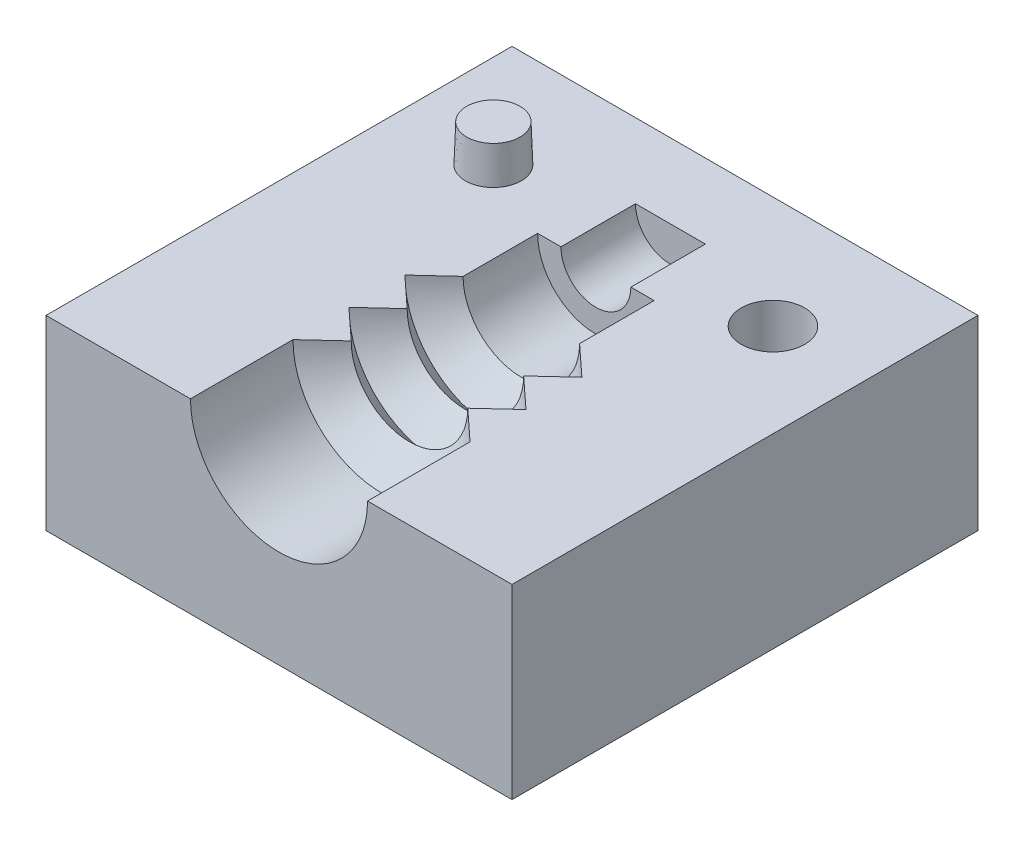
ISO-10303-21;
HEADER;
FILE_DESCRIPTION(('STEP AP214'),'2;1');
FILE_NAME('part.step','',(''),(''),'','','');
FILE_SCHEMA(('AUTOMOTIVE_DESIGN { 1 0 10303 214 1 1 1 1 }'));
ENDSEC;
DATA;
#1=APPLICATION_CONTEXT('core data for automotive mechanical design processes');
#2=APPLICATION_PROTOCOL_DEFINITION('international standard','automotive_design',2000,#1);
#3=PRODUCT_CONTEXT('',#1,'mechanical');
#4=PRODUCT('Part','Part','',(#3));
#5=PRODUCT_RELATED_PRODUCT_CATEGORY('part','',(#4));
#6=PRODUCT_DEFINITION_FORMATION('','',#4);
#7=PRODUCT_DEFINITION_CONTEXT('part definition',#1,'design');
#8=PRODUCT_DEFINITION('design','',#6,#7);
#9=PRODUCT_DEFINITION_SHAPE('','',#8);
#10=(LENGTH_UNIT() NAMED_UNIT(*) SI_UNIT(.MILLI.,.METRE.));
#11=(NAMED_UNIT(*) PLANE_ANGLE_UNIT() SI_UNIT($,.RADIAN.));
#12=(NAMED_UNIT(*) SI_UNIT($,.STERADIAN.) SOLID_ANGLE_UNIT());
#13=UNCERTAINTY_MEASURE_WITH_UNIT(LENGTH_MEASURE(1.E-05),#10,'distance_accuracy_value','');
#14=(GEOMETRIC_REPRESENTATION_CONTEXT(3) GLOBAL_UNCERTAINTY_ASSIGNED_CONTEXT((#13)) GLOBAL_UNIT_ASSIGNED_CONTEXT((#10,
#11,#12)) REPRESENTATION_CONTEXT('',''));
#15=CARTESIAN_POINT('',(0.,0.,0.));
#16=DIRECTION('',(0.,0.,1.));
#17=DIRECTION('',(1.,0.,0.));
#18=AXIS2_PLACEMENT_3D('',#15,#16,#17);
#19=CARTESIAN_POINT('',(0.,10.,0.));
#20=DIRECTION('',(0.,1.,0.));
#21=DIRECTION('',(0.,0.,1.));
#22=AXIS2_PLACEMENT_3D('',#19,#20,#21);
#23=PLANE('',#22);
#24=CARTESIAN_POINT('',(7.50000000000001,10.,-6.5));
#25=DIRECTION('',(0.,1.,0.));
#26=DIRECTION('',(0.,0.,1.));
#27=AXIS2_PLACEMENT_3D('',#24,#25,#26);
#28=CIRCLE('',#27,1.7);
#29=CARTESIAN_POINT('',(7.50000000000001,10.,-4.8));
#30=VERTEX_POINT('',#29);
#31=EDGE_CURVE('E322',#30,#30,#28,.T.);
#32=ORIENTED_EDGE('',*,*,#31,.F.);
#33=EDGE_LOOP('',(#32));
#34=FACE_BOUND('',#33,.T.);
#35=CARTESIAN_POINT('',(-7.50000000000001,10.,-6.5));
#36=DIRECTION('',(0.,1.,0.));
#37=DIRECTION('',(0.,0.,1.));
#38=AXIS2_PLACEMENT_3D('',#35,#36,#37);
#39=CIRCLE('',#38,1.5);
#40=CARTESIAN_POINT('',(-7.50000000000001,10.,-5.));
#41=VERTEX_POINT('',#40);
#42=EDGE_CURVE('E321',#41,#41,#39,.T.);
#43=ORIENTED_EDGE('',*,*,#42,.F.);
#44=EDGE_LOOP('',(#43));
#45=FACE_BOUND('',#44,.T.);
#46=DIRECTION('',(-0.734803444627489,0.,-0.678280102733065));
#47=VECTOR('',#46,1.);
#48=CARTESIAN_POINT('',(0.,10.,2.61538461538462));
#49=LINE('',#48,#47);
#50=CARTESIAN_POINT('',(3.125,10.,5.5));
#51=VERTEX_POINT('',#50);
#52=CARTESIAN_POINT('',(4.75,10.,7.));
#53=VERTEX_POINT('',#52);
#54=EDGE_CURVE('E198',#51,#53,#49,.F.);
#55=ORIENTED_EDGE('',*,*,#54,.T.);
#56=DIRECTION('',(0.,0.,-1.));
#57=VECTOR('',#56,1.);
#58=CARTESIAN_POINT('',(4.75,10.,-12.5));
#59=LINE('',#58,#57);
#60=CARTESIAN_POINT('',(4.75,10.,12.5));
#61=VERTEX_POINT('',#60);
#62=EDGE_CURVE('E11',#53,#61,#59,.F.);
#63=ORIENTED_EDGE('',*,*,#62,.T.);
#64=DIRECTION('',(1.,0.,0.));
#65=VECTOR('',#64,1.);
#66=CARTESIAN_POINT('',(-12.5,10.,12.5));
#67=LINE('',#66,#65);
#68=CARTESIAN_POINT('',(12.5,10.,12.5));
#69=VERTEX_POINT('',#68);
#70=EDGE_CURVE('E212',#61,#69,#67,.T.);
#71=ORIENTED_EDGE('',*,*,#70,.T.);
#72=DIRECTION('',(0.,0.,-1.));
#73=VECTOR('',#72,1.);
#74=CARTESIAN_POINT('',(12.5,10.,-12.5));
#75=LINE('',#74,#73);
#76=CARTESIAN_POINT('',(12.5,10.,-12.5));
#77=VERTEX_POINT('',#76);
#78=EDGE_CURVE('E225',#69,#77,#75,.T.);
#79=ORIENTED_EDGE('',*,*,#78,.T.);
#80=DIRECTION('',(-1.,0.,0.));
#81=VECTOR('',#80,1.);
#82=CARTESIAN_POINT('',(-12.5,10.,-12.5));
#83=LINE('',#82,#81);
#84=CARTESIAN_POINT('',(-12.5,10.,-12.5));
#85=VERTEX_POINT('',#84);
#86=EDGE_CURVE('E56',#77,#85,#83,.T.);
#87=ORIENTED_EDGE('',*,*,#86,.T.);
#88=DIRECTION('',(0.,0.,1.));
#89=VECTOR('',#88,1.);
#90=CARTESIAN_POINT('',(-12.5,10.,-12.5));
#91=LINE('',#90,#89);
#92=CARTESIAN_POINT('',(-12.5,10.,12.5));
#93=VERTEX_POINT('',#92);
#94=EDGE_CURVE('E222',#85,#93,#91,.T.);
#95=ORIENTED_EDGE('',*,*,#94,.T.);
#96=CARTESIAN_POINT('',(-4.75000000000001,10.,12.5));
#97=VERTEX_POINT('',#96);
#98=EDGE_CURVE('E85',#93,#97,#67,.T.);
#99=ORIENTED_EDGE('',*,*,#98,.T.);
#100=DIRECTION('',(0.,0.,-1.));
#101=VECTOR('',#100,1.);
#102=CARTESIAN_POINT('',(-4.75000000000001,10.,-12.5));
#103=LINE('',#102,#101);
#104=CARTESIAN_POINT('',(-4.75000000000001,10.,7.));
#105=VERTEX_POINT('',#104);
#106=EDGE_CURVE('E41',#97,#105,#103,.T.);
#107=ORIENTED_EDGE('',*,*,#106,.T.);
#108=DIRECTION('',(-0.734803444627489,0.,0.678280102733065));
#109=VECTOR('',#108,1.);
#110=CARTESIAN_POINT('',(0.,10.,2.61538461538462));
#111=LINE('',#110,#109);
#112=CARTESIAN_POINT('',(-3.12500000000001,10.,5.5));
#113=VERTEX_POINT('',#112);
#114=EDGE_CURVE('E200',#105,#113,#111,.F.);
#115=ORIENTED_EDGE('',*,*,#114,.T.);
#116=DIRECTION('',(0.734803444627488,0.,0.678280102733066));
#117=VECTOR('',#116,1.);
#118=CARTESIAN_POINT('',(0.,10.,8.38461538461539));
#119=LINE('',#118,#117);
#120=CARTESIAN_POINT('',(-4.75000000000001,10.,4.));
#121=VERTEX_POINT('',#120);
#122=EDGE_CURVE('E192',#113,#121,#119,.F.);
#123=ORIENTED_EDGE('',*,*,#122,.T.);
#124=DIRECTION('',(-0.734803444627488,0.,0.678280102733065));
#125=VECTOR('',#124,1.);
#126=CARTESIAN_POINT('',(0.,10.,-0.384615384615382));
#127=LINE('',#126,#125);
#128=CARTESIAN_POINT('',(-3.12500000000001,10.,2.5));
#129=VERTEX_POINT('',#128);
#130=EDGE_CURVE('E189',#121,#129,#127,.F.);
#131=ORIENTED_EDGE('',*,*,#130,.T.);
#132=DIRECTION('',(0.734803444627488,0.,0.678280102733066));
#133=VECTOR('',#132,1.);
#134=CARTESIAN_POINT('',(0.,10.,5.38461538461539));
#135=LINE('',#134,#133);
#136=CARTESIAN_POINT('',(-4.75000000000001,10.,1.));
#137=VERTEX_POINT('',#136);
#138=EDGE_CURVE('E180',#129,#137,#135,.F.);
#139=ORIENTED_EDGE('',*,*,#138,.T.);
#140=DIRECTION('',(-0.734803444627488,0.,0.678280102733066));
#141=VECTOR('',#140,1.);
#142=CARTESIAN_POINT('',(0.,10.,-3.38461538461539));
#143=LINE('',#142,#141);
#144=CARTESIAN_POINT('',(-3.12500000000001,10.,-0.499999999999998));
#145=VERTEX_POINT('',#144);
#146=EDGE_CURVE('E177',#137,#145,#143,.F.);
#147=ORIENTED_EDGE('',*,*,#146,.T.);
#148=DIRECTION('',(0.,0.,-1.));
#149=VECTOR('',#148,1.);
#150=CARTESIAN_POINT('',(-3.12500000000001,10.,-12.5));
#151=LINE('',#150,#149);
#152=CARTESIAN_POINT('',(-3.12500000000001,10.,-4.5));
#153=VERTEX_POINT('',#152);
#154=EDGE_CURVE('E169',#145,#153,#151,.T.);
#155=ORIENTED_EDGE('',*,*,#154,.T.);
#156=DIRECTION('',(1.,0.,0.));
#157=VECTOR('',#156,1.);
#158=CARTESIAN_POINT('',(0.,10.,-4.5));
#159=LINE('',#158,#157);
#160=CARTESIAN_POINT('',(-1.87500000000001,10.,-4.5));
#161=VERTEX_POINT('',#160);
#162=EDGE_CURVE('E161',#153,#161,#159,.T.);
#163=ORIENTED_EDGE('',*,*,#162,.T.);
#164=DIRECTION('',(0.,0.,-1.));
#165=VECTOR('',#164,1.);
#166=CARTESIAN_POINT('',(-1.87500000000001,10.,-12.5));
#167=LINE('',#166,#165);
#168=CARTESIAN_POINT('',(-1.87500000000001,10.,-8.5));
#169=VERTEX_POINT('',#168);
#170=EDGE_CURVE('E147',#161,#169,#167,.T.);
#171=ORIENTED_EDGE('',*,*,#170,.T.);
#172=DIRECTION('',(1.,0.,0.));
#173=VECTOR('',#172,1.);
#174=CARTESIAN_POINT('',(0.,10.,-8.5));
#175=LINE('',#174,#173);
#176=CARTESIAN_POINT('',(1.875,10.,-8.5));
#177=VERTEX_POINT('',#176);
#178=EDGE_CURVE('E143',#169,#177,#175,.T.);
#179=ORIENTED_EDGE('',*,*,#178,.T.);
#180=DIRECTION('',(0.,0.,-1.));
#181=VECTOR('',#180,1.);
#182=CARTESIAN_POINT('',(1.875,10.,-12.5));
#183=LINE('',#182,#181);
#184=CARTESIAN_POINT('',(1.875,10.,-4.5));
#185=VERTEX_POINT('',#184);
#186=EDGE_CURVE('E154',#177,#185,#183,.F.);
#187=ORIENTED_EDGE('',*,*,#186,.T.);
#188=CARTESIAN_POINT('',(3.125,10.,-4.5));
#189=VERTEX_POINT('',#188);
#190=EDGE_CURVE('E163',#185,#189,#159,.T.);
#191=ORIENTED_EDGE('',*,*,#190,.T.);
#192=DIRECTION('',(0.,0.,-1.));
#193=VECTOR('',#192,1.);
#194=CARTESIAN_POINT('',(3.125,10.,-12.5));
#195=LINE('',#194,#193);
#196=CARTESIAN_POINT('',(3.125,10.,-0.499999999999999));
#197=VERTEX_POINT('',#196);
#198=EDGE_CURVE('E171',#189,#197,#195,.F.);
#199=ORIENTED_EDGE('',*,*,#198,.T.);
#200=DIRECTION('',(-0.734803444627488,0.,-0.678280102733066));
#201=VECTOR('',#200,1.);
#202=CARTESIAN_POINT('',(0.,10.,-3.38461538461539));
#203=LINE('',#202,#201);
#204=CARTESIAN_POINT('',(4.75,10.,1.));
#205=VERTEX_POINT('',#204);
#206=EDGE_CURVE('E174',#197,#205,#203,.F.);
#207=ORIENTED_EDGE('',*,*,#206,.T.);
#208=DIRECTION('',(0.734803444627488,0.,-0.678280102733066));
#209=VECTOR('',#208,1.);
#210=CARTESIAN_POINT('',(0.,10.,5.38461538461539));
#211=LINE('',#210,#209);
#212=CARTESIAN_POINT('',(3.125,10.,2.5));
#213=VERTEX_POINT('',#212);
#214=EDGE_CURVE('E183',#205,#213,#211,.F.);
#215=ORIENTED_EDGE('',*,*,#214,.T.);
#216=DIRECTION('',(-0.734803444627488,0.,-0.678280102733065));
#217=VECTOR('',#216,1.);
#218=CARTESIAN_POINT('',(0.,10.,-0.384615384615382));
#219=LINE('',#218,#217);
#220=CARTESIAN_POINT('',(4.75,10.,4.));
#221=VERTEX_POINT('',#220);
#222=EDGE_CURVE('E186',#213,#221,#219,.F.);
#223=ORIENTED_EDGE('',*,*,#222,.T.);
#224=DIRECTION('',(0.734803444627488,0.,-0.678280102733066));
#225=VECTOR('',#224,1.);
#226=CARTESIAN_POINT('',(0.,10.,8.38461538461539));
#227=LINE('',#226,#225);
#228=EDGE_CURVE('E195',#221,#51,#227,.F.);
#229=ORIENTED_EDGE('',*,*,#228,.T.);
#230=EDGE_LOOP('',(#55,#63,#71,#79,#87,#95,#99,#107,#115,#123,#131,#139,#147,#155,#163,#171,
#179,#187,#191,#199,#207,#215,#223,#229));
#231=FACE_BOUND('',#230,.T.);
#232=ADVANCED_FACE('F33',(#34,#45,#231),#23,.T.);
#233=CARTESIAN_POINT('',(-12.5,10.,-12.5));
#234=DIRECTION('',(1.,0.,0.));
#235=DIRECTION('',(0.,0.,-1.));
#236=AXIS2_PLACEMENT_3D('',#233,#234,#235);
#237=PLANE('',#236);
#238=DIRECTION('',(0.,0.,1.));
#239=VECTOR('',#238,1.);
#240=CARTESIAN_POINT('',(-12.5,0.,-12.5));
#241=LINE('',#240,#239);
#242=CARTESIAN_POINT('',(-12.5,0.,-12.5));
#243=VERTEX_POINT('',#242);
#244=CARTESIAN_POINT('',(-12.5,0.,12.5));
#245=VERTEX_POINT('',#244);
#246=EDGE_CURVE('E213',#243,#245,#241,.T.);
#247=ORIENTED_EDGE('',*,*,#246,.T.);
#248=DIRECTION('',(0.,-1.,0.));
#249=VECTOR('',#248,1.);
#250=CARTESIAN_POINT('',(-12.5,10.,12.5));
#251=LINE('',#250,#249);
#252=EDGE_CURVE('E148',#93,#245,#251,.T.);
#253=ORIENTED_EDGE('',*,*,#252,.F.);
#254=ORIENTED_EDGE('',*,*,#94,.F.);
#255=DIRECTION('',(0.,-1.,0.));
#256=VECTOR('',#255,1.);
#257=CARTESIAN_POINT('',(-12.5,10.,-12.5));
#258=LINE('',#257,#256);
#259=EDGE_CURVE('E227',#85,#243,#258,.T.);
#260=ORIENTED_EDGE('',*,*,#259,.T.);
#261=EDGE_LOOP('',(#247,#253,#254,#260));
#262=FACE_BOUND('',#261,.T.);
#263=ADVANCED_FACE('F35',(#262),#237,.F.);
#264=CARTESIAN_POINT('',(-12.5,10.,12.5));
#265=DIRECTION('',(0.,0.,-1.));
#266=DIRECTION('',(-1.,0.,0.));
#267=AXIS2_PLACEMENT_3D('',#264,#265,#266);
#268=PLANE('',#267);
#269=CARTESIAN_POINT('',(0.,10.,12.5));
#270=DIRECTION('',(0.,0.,-1.));
#271=DIRECTION('',(-1.,0.,0.));
#272=AXIS2_PLACEMENT_3D('',#269,#270,#271);
#273=CIRCLE('',#272,4.75);
#274=EDGE_CURVE('E206',#61,#97,#273,.T.);
#275=ORIENTED_EDGE('',*,*,#274,.T.);
#276=ORIENTED_EDGE('',*,*,#98,.F.);
#277=ORIENTED_EDGE('',*,*,#252,.T.);
#278=DIRECTION('',(1.,0.,0.));
#279=VECTOR('',#278,1.);
#280=CARTESIAN_POINT('',(-12.5,0.,12.5));
#281=LINE('',#280,#279);
#282=CARTESIAN_POINT('',(12.5,0.,12.5));
#283=VERTEX_POINT('',#282);
#284=EDGE_CURVE('E216',#245,#283,#281,.T.);
#285=ORIENTED_EDGE('',*,*,#284,.T.);
#286=DIRECTION('',(0.,-1.,0.));
#287=VECTOR('',#286,1.);
#288=CARTESIAN_POINT('',(12.5,10.,12.5));
#289=LINE('',#288,#287);
#290=EDGE_CURVE('E236',#69,#283,#289,.T.);
#291=ORIENTED_EDGE('',*,*,#290,.F.);
#292=ORIENTED_EDGE('',*,*,#70,.F.);
#293=EDGE_LOOP('',(#275,#276,#277,#285,#291,#292));
#294=FACE_BOUND('',#293,.T.);
#295=ADVANCED_FACE('F210',(#294),#268,.F.);
#296=CARTESIAN_POINT('',(12.5,10.,-12.5));
#297=DIRECTION('',(-1.,0.,0.));
#298=DIRECTION('',(0.,0.,1.));
#299=AXIS2_PLACEMENT_3D('',#296,#297,#298);
#300=PLANE('',#299);
#301=DIRECTION('',(0.,0.,-1.));
#302=VECTOR('',#301,1.);
#303=CARTESIAN_POINT('',(12.5,0.,-12.5));
#304=LINE('',#303,#302);
#305=CARTESIAN_POINT('',(12.5,0.,-12.5));
#306=VERTEX_POINT('',#305);
#307=EDGE_CURVE('E230',#283,#306,#304,.T.);
#308=ORIENTED_EDGE('',*,*,#307,.T.);
#309=DIRECTION('',(0.,-1.,0.));
#310=VECTOR('',#309,1.);
#311=CARTESIAN_POINT('',(12.5,10.,-12.5));
#312=LINE('',#311,#310);
#313=EDGE_CURVE('E234',#77,#306,#312,.T.);
#314=ORIENTED_EDGE('',*,*,#313,.F.);
#315=ORIENTED_EDGE('',*,*,#78,.F.);
#316=ORIENTED_EDGE('',*,*,#290,.T.);
#317=EDGE_LOOP('',(#308,#314,#315,#316));
#318=FACE_BOUND('',#317,.T.);
#319=ADVANCED_FACE('F247',(#318),#300,.F.);
#320=CARTESIAN_POINT('',(-12.5,10.,-12.5));
#321=DIRECTION('',(0.,0.,1.));
#322=DIRECTION('',(1.,0.,0.));
#323=AXIS2_PLACEMENT_3D('',#320,#321,#322);
#324=PLANE('',#323);
#325=DIRECTION('',(-1.,0.,0.));
#326=VECTOR('',#325,1.);
#327=CARTESIAN_POINT('',(-12.5,0.,-12.5));
#328=LINE('',#327,#326);
#329=EDGE_CURVE('E77',#306,#243,#328,.T.);
#330=ORIENTED_EDGE('',*,*,#329,.T.);
#331=ORIENTED_EDGE('',*,*,#259,.F.);
#332=ORIENTED_EDGE('',*,*,#86,.F.);
#333=ORIENTED_EDGE('',*,*,#313,.T.);
#334=EDGE_LOOP('',(#330,#331,#332,#333));
#335=FACE_BOUND('',#334,.T.);
#336=ADVANCED_FACE('F249',(#335),#324,.F.);
#337=CARTESIAN_POINT('',(0.,0.,0.));
#338=DIRECTION('',(0.,1.,0.));
#339=DIRECTION('',(0.,0.,1.));
#340=AXIS2_PLACEMENT_3D('',#337,#338,#339);
#341=PLANE('',#340);
#342=ORIENTED_EDGE('',*,*,#246,.F.);
#343=ORIENTED_EDGE('',*,*,#329,.F.);
#344=ORIENTED_EDGE('',*,*,#307,.F.);
#345=ORIENTED_EDGE('',*,*,#284,.F.);
#346=EDGE_LOOP('',(#342,#343,#344,#345));
#347=FACE_BOUND('',#346,.T.);
#348=ADVANCED_FACE('F243',(#347),#341,.F.);
#349=CARTESIAN_POINT('',(0.,10.,-12.5));
#350=DIRECTION('',(0.,0.,-1.));
#351=DIRECTION('',(-1.,0.,0.));
#352=AXIS2_PLACEMENT_3D('',#349,#350,#351);
#353=CYLINDRICAL_SURFACE('',#352,4.75);
#354=CARTESIAN_POINT('',(0.,10.,7.));
#355=DIRECTION('',(0.,0.,-1.));
#356=DIRECTION('',(-1.,0.,0.));
#357=AXIS2_PLACEMENT_3D('',#354,#355,#356);
#358=CIRCLE('',#357,4.75000000000001);
#359=EDGE_CURVE('E208',#53,#105,#358,.T.);
#360=ORIENTED_EDGE('',*,*,#359,.T.);
#361=ORIENTED_EDGE('',*,*,#106,.F.);
#362=ORIENTED_EDGE('',*,*,#274,.F.);
#363=ORIENTED_EDGE('',*,*,#62,.F.);
#364=EDGE_LOOP('',(#360,#361,#362,#363));
#365=FACE_BOUND('',#364,.T.);
#366=ADVANCED_FACE('F205',(#365),#353,.F.);
#367=CARTESIAN_POINT('',(0.,10.,7.));
#368=DIRECTION('',(0.,0.,1.));
#369=DIRECTION('',(1.,0.,0.));
#370=AXIS2_PLACEMENT_3D('',#367,#368,#369);
#371=CONICAL_SURFACE('',#370,4.75000000000001,0.82537685052074);
#372=ORIENTED_EDGE('',*,*,#359,.F.);
#373=ORIENTED_EDGE('',*,*,#54,.F.);
#374=CARTESIAN_POINT('',(0.,10.,5.5));
#375=DIRECTION('',(0.,0.,-1.));
#376=DIRECTION('',(-1.,0.,0.));
#377=AXIS2_PLACEMENT_3D('',#374,#375,#376);
#378=CIRCLE('',#377,3.125);
#379=EDGE_CURVE('E218',#51,#113,#378,.T.);
#380=ORIENTED_EDGE('',*,*,#379,.T.);
#381=ORIENTED_EDGE('',*,*,#114,.F.);
#382=EDGE_LOOP('',(#372,#373,#380,#381));
#383=FACE_BOUND('',#382,.T.);
#384=ADVANCED_FACE('F269',(#383),#371,.F.);
#385=CARTESIAN_POINT('',(0.,10.,5.5));
#386=DIRECTION('',(0.,0.,-1.));
#387=DIRECTION('',(-1.,0.,0.));
#388=AXIS2_PLACEMENT_3D('',#385,#386,#387);
#389=CONICAL_SURFACE('',#388,3.125,0.825376850520738);
#390=CARTESIAN_POINT('',(0.,10.,4.));
#391=DIRECTION('',(0.,0.,-1.));
#392=DIRECTION('',(-1.,0.,0.));
#393=AXIS2_PLACEMENT_3D('',#390,#391,#392);
#394=CIRCLE('',#393,4.75);
#395=EDGE_CURVE('E344',#221,#121,#394,.T.);
#396=ORIENTED_EDGE('',*,*,#395,.T.);
#397=ORIENTED_EDGE('',*,*,#122,.F.);
#398=ORIENTED_EDGE('',*,*,#379,.F.);
#399=ORIENTED_EDGE('',*,*,#228,.F.);
#400=EDGE_LOOP('',(#396,#397,#398,#399));
#401=FACE_BOUND('',#400,.T.);
#402=ADVANCED_FACE('F272',(#401),#389,.F.);
#403=CARTESIAN_POINT('',(0.,10.,4.));
#404=DIRECTION('',(0.,0.,1.));
#405=DIRECTION('',(1.,0.,0.));
#406=AXIS2_PLACEMENT_3D('',#403,#404,#405);
#407=CONICAL_SURFACE('',#406,4.75,0.825376850520739);
#408=ORIENTED_EDGE('',*,*,#395,.F.);
#409=ORIENTED_EDGE('',*,*,#222,.F.);
#410=CARTESIAN_POINT('',(0.,10.,2.5));
#411=DIRECTION('',(0.,0.,-1.));
#412=DIRECTION('',(-1.,0.,0.));
#413=AXIS2_PLACEMENT_3D('',#410,#411,#412);
#414=CIRCLE('',#413,3.125);
#415=EDGE_CURVE('E341',#213,#129,#414,.T.);
#416=ORIENTED_EDGE('',*,*,#415,.T.);
#417=ORIENTED_EDGE('',*,*,#130,.F.);
#418=EDGE_LOOP('',(#408,#409,#416,#417));
#419=FACE_BOUND('',#418,.T.);
#420=ADVANCED_FACE('F276',(#419),#407,.F.);
#421=CARTESIAN_POINT('',(0.,10.,2.5));
#422=DIRECTION('',(0.,0.,-1.));
#423=DIRECTION('',(-1.,0.,0.));
#424=AXIS2_PLACEMENT_3D('',#421,#422,#423);
#425=CONICAL_SURFACE('',#424,3.125,0.825376850520738);
#426=CARTESIAN_POINT('',(0.,10.,1.));
#427=DIRECTION('',(0.,0.,-1.));
#428=DIRECTION('',(-1.,0.,0.));
#429=AXIS2_PLACEMENT_3D('',#426,#427,#428);
#430=CIRCLE('',#429,4.75000000000001);
#431=EDGE_CURVE('E338',#205,#137,#430,.T.);
#432=ORIENTED_EDGE('',*,*,#431,.T.);
#433=ORIENTED_EDGE('',*,*,#138,.F.);
#434=ORIENTED_EDGE('',*,*,#415,.F.);
#435=ORIENTED_EDGE('',*,*,#214,.F.);
#436=EDGE_LOOP('',(#432,#433,#434,#435));
#437=FACE_BOUND('',#436,.T.);
#438=ADVANCED_FACE('F280',(#437),#425,.F.);
#439=CARTESIAN_POINT('',(0.,10.,1.));
#440=DIRECTION('',(0.,0.,1.));
#441=DIRECTION('',(1.,0.,0.));
#442=AXIS2_PLACEMENT_3D('',#439,#440,#441);
#443=CONICAL_SURFACE('',#442,4.75000000000001,0.825376850520738);
#444=ORIENTED_EDGE('',*,*,#431,.F.);
#445=ORIENTED_EDGE('',*,*,#206,.F.);
#446=CARTESIAN_POINT('',(0.,10.,-0.499999999999999));
#447=DIRECTION('',(0.,0.,-1.));
#448=DIRECTION('',(-1.,0.,0.));
#449=AXIS2_PLACEMENT_3D('',#446,#447,#448);
#450=CIRCLE('',#449,3.125);
#451=EDGE_CURVE('E335',#197,#145,#450,.T.);
#452=ORIENTED_EDGE('',*,*,#451,.T.);
#453=ORIENTED_EDGE('',*,*,#146,.F.);
#454=EDGE_LOOP('',(#444,#445,#452,#453));
#455=FACE_BOUND('',#454,.T.);
#456=ADVANCED_FACE('F284',(#455),#443,.F.);
#457=CARTESIAN_POINT('',(0.,10.,-12.5));
#458=DIRECTION('',(0.,0.,-1.));
#459=DIRECTION('',(-1.,0.,0.));
#460=AXIS2_PLACEMENT_3D('',#457,#458,#459);
#461=CYLINDRICAL_SURFACE('',#460,3.125);
#462=CARTESIAN_POINT('',(0.,10.,-4.5));
#463=DIRECTION('',(0.,0.,-1.));
#464=DIRECTION('',(-1.,0.,0.));
#465=AXIS2_PLACEMENT_3D('',#462,#463,#464);
#466=CIRCLE('',#465,3.125);
#467=EDGE_CURVE('E332',#189,#153,#466,.T.);
#468=ORIENTED_EDGE('',*,*,#467,.T.);
#469=ORIENTED_EDGE('',*,*,#154,.F.);
#470=ORIENTED_EDGE('',*,*,#451,.F.);
#471=ORIENTED_EDGE('',*,*,#198,.F.);
#472=EDGE_LOOP('',(#468,#469,#470,#471));
#473=FACE_BOUND('',#472,.T.);
#474=ADVANCED_FACE('F288',(#473),#461,.F.);
#475=CARTESIAN_POINT('',(3.125,10.,-4.5));
#476=DIRECTION('',(0.,0.,1.));
#477=DIRECTION('',(1.,0.,0.));
#478=AXIS2_PLACEMENT_3D('',#475,#476,#477);
#479=PLANE('',#478);
#480=ORIENTED_EDGE('',*,*,#467,.F.);
#481=ORIENTED_EDGE('',*,*,#190,.F.);
#482=CARTESIAN_POINT('',(0.,10.,-4.5));
#483=DIRECTION('',(0.,0.,-1.));
#484=DIRECTION('',(-1.,0.,0.));
#485=AXIS2_PLACEMENT_3D('',#482,#483,#484);
#486=CIRCLE('',#485,1.87500000000001);
#487=EDGE_CURVE('E155',#185,#161,#486,.T.);
#488=ORIENTED_EDGE('',*,*,#487,.T.);
#489=ORIENTED_EDGE('',*,*,#162,.F.);
#490=EDGE_LOOP('',(#480,#481,#488,#489));
#491=FACE_BOUND('',#490,.T.);
#492=ADVANCED_FACE('F292',(#491),#479,.T.);
#493=CARTESIAN_POINT('',(0.,10.,-12.5));
#494=DIRECTION('',(0.,0.,-1.));
#495=DIRECTION('',(-1.,0.,0.));
#496=AXIS2_PLACEMENT_3D('',#493,#494,#495);
#497=CYLINDRICAL_SURFACE('',#496,1.87500000000001);
#498=CARTESIAN_POINT('',(0.,10.,-8.5));
#499=DIRECTION('',(0.,0.,-1.));
#500=DIRECTION('',(-1.,0.,0.));
#501=AXIS2_PLACEMENT_3D('',#498,#499,#500);
#502=CIRCLE('',#501,1.87500000000001);
#503=EDGE_CURVE('E47',#177,#169,#502,.T.);
#504=ORIENTED_EDGE('',*,*,#503,.T.);
#505=ORIENTED_EDGE('',*,*,#170,.F.);
#506=ORIENTED_EDGE('',*,*,#487,.F.);
#507=ORIENTED_EDGE('',*,*,#186,.F.);
#508=EDGE_LOOP('',(#504,#505,#506,#507));
#509=FACE_BOUND('',#508,.T.);
#510=ADVANCED_FACE('F151',(#509),#497,.F.);
#511=CARTESIAN_POINT('',(1.875,10.,-8.5));
#512=DIRECTION('',(0.,0.,1.));
#513=DIRECTION('',(1.,0.,0.));
#514=AXIS2_PLACEMENT_3D('',#511,#512,#513);
#515=PLANE('',#514);
#516=ORIENTED_EDGE('',*,*,#503,.F.);
#517=ORIENTED_EDGE('',*,*,#178,.F.);
#518=EDGE_LOOP('',(#516,#517));
#519=FACE_BOUND('',#518,.T.);
#520=ADVANCED_FACE('F144',(#519),#515,.T.);
#521=CARTESIAN_POINT('',(-7.50000000000001,10.,-6.5));
#522=DIRECTION('',(0.,-1.,0.));
#523=DIRECTION('',(0.,0.,1.));
#524=AXIS2_PLACEMENT_3D('',#521,#522,#523);
#525=CONICAL_SURFACE('',#524,1.5,0.0349065850398867);
#526=CARTESIAN_POINT('',(-7.50000000000001,12.,-6.5));
#527=DIRECTION('',(0.,1.,0.));
#528=DIRECTION('',(0.,0.,1.));
#529=AXIS2_PLACEMENT_3D('',#526,#527,#528);
#530=CIRCLE('',#529,1.4301584610165);
#531=CARTESIAN_POINT('',(-7.50000000000001,12.,-5.0698415389835));
#532=VERTEX_POINT('',#531);
#533=EDGE_CURVE('E156',#532,#532,#530,.T.);
#534=ORIENTED_EDGE('',*,*,#533,.F.);
#535=EDGE_LOOP('',(#534));
#536=FACE_BOUND('',#535,.T.);
#537=ORIENTED_EDGE('',*,*,#42,.T.);
#538=EDGE_LOOP('',(#537));
#539=FACE_BOUND('',#538,.T.);
#540=ADVANCED_FACE('F301',(#536,#539),#525,.T.);
#541=CARTESIAN_POINT('',(-7.50000000000001,12.,-6.5));
#542=DIRECTION('',(0.,1.,0.));
#543=DIRECTION('',(0.,0.,1.));
#544=AXIS2_PLACEMENT_3D('',#541,#542,#543);
#545=PLANE('',#544);
#546=ORIENTED_EDGE('',*,*,#533,.T.);
#547=EDGE_LOOP('',(#546));
#548=FACE_BOUND('',#547,.T.);
#549=ADVANCED_FACE('F304',(#548),#545,.T.);
#550=CARTESIAN_POINT('',(7.50000000000001,7.5,-6.5));
#551=DIRECTION('',(0.,1.,0.));
#552=DIRECTION('',(0.,0.,1.));
#553=AXIS2_PLACEMENT_3D('',#550,#551,#552);
#554=CYLINDRICAL_SURFACE('',#553,1.7);
#555=CARTESIAN_POINT('',(7.50000000000001,7.5,-6.5));
#556=DIRECTION('',(0.,1.,0.));
#557=DIRECTION('',(0.,0.,1.));
#558=AXIS2_PLACEMENT_3D('',#555,#556,#557);
#559=CIRCLE('',#558,1.7);
#560=CARTESIAN_POINT('',(7.50000000000001,7.5,-4.8));
#561=VERTEX_POINT('',#560);
#562=EDGE_CURVE('E320',#561,#561,#559,.T.);
#563=ORIENTED_EDGE('',*,*,#562,.F.);
#564=EDGE_LOOP('',(#563));
#565=FACE_BOUND('',#564,.T.);
#566=ORIENTED_EDGE('',*,*,#31,.T.);
#567=EDGE_LOOP('',(#566));
#568=FACE_BOUND('',#567,.T.);
#569=ADVANCED_FACE('F308',(#565,#568),#554,.F.);
#570=CARTESIAN_POINT('',(7.50000000000001,7.5,-6.5));
#571=DIRECTION('',(0.,1.,0.));
#572=DIRECTION('',(0.,0.,1.));
#573=AXIS2_PLACEMENT_3D('',#570,#571,#572);
#574=PLANE('',#573);
#575=ORIENTED_EDGE('',*,*,#562,.T.);
#576=EDGE_LOOP('',(#575));
#577=FACE_BOUND('',#576,.T.);
#578=ADVANCED_FACE('F312',(#577),#574,.T.);
#579=CLOSED_SHELL('',(#232,#263,#295,#319,#336,#348,#366,#384,#402,#420,#438,#456,#474,#492,
#510,#520,#540,#549,#569,#578));
#580=MANIFOLD_SOLID_BREP('B2',#579);
#581=ADVANCED_BREP_SHAPE_REPRESENTATION('',(#18,#580),#14);
#582=SHAPE_DEFINITION_REPRESENTATION(#9,#581);
ENDSEC;
END-ISO-10303-21;
